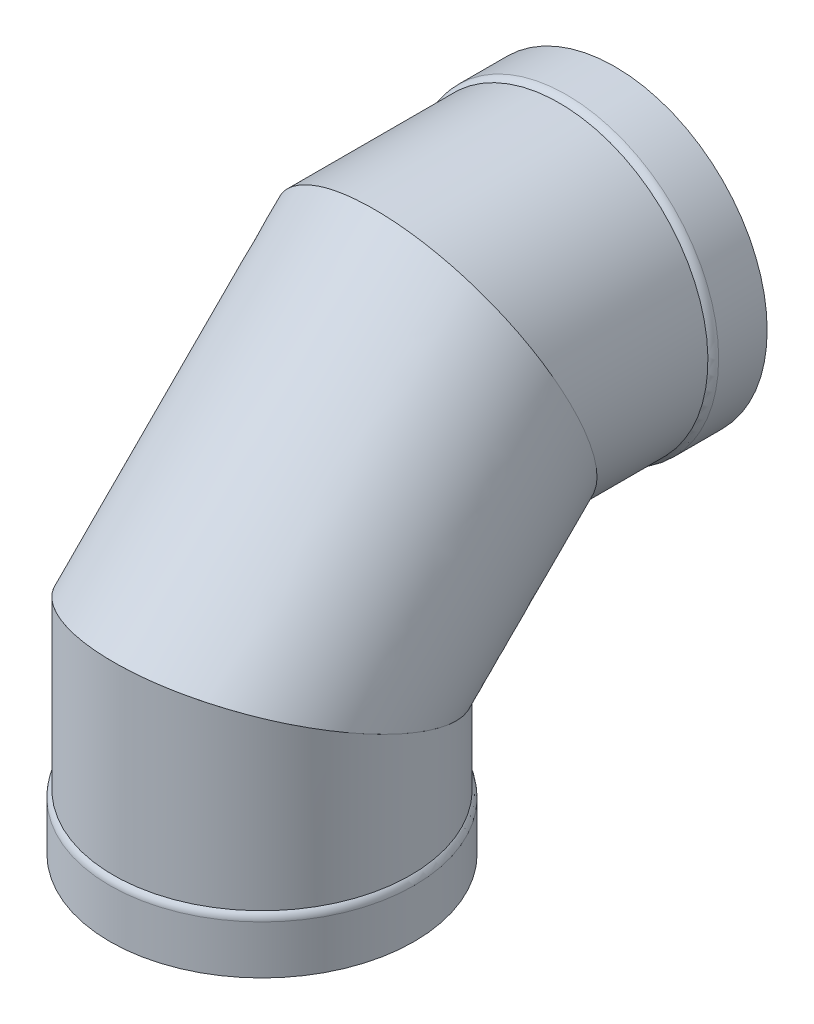
ISO-10303-21;
HEADER;
FILE_DESCRIPTION(('STEP AP214'),'2;1');
FILE_NAME('part.step','',(''),(''),'','','');
FILE_SCHEMA(('AUTOMOTIVE_DESIGN { 1 0 10303 214 1 1 1 1 }'));
ENDSEC;
DATA;
#1=APPLICATION_CONTEXT('core data for automotive mechanical design processes');
#2=APPLICATION_PROTOCOL_DEFINITION('international standard','automotive_design',2000,#1);
#3=PRODUCT_CONTEXT('',#1,'mechanical');
#4=PRODUCT('Part','Part','',(#3));
#5=PRODUCT_RELATED_PRODUCT_CATEGORY('part','',(#4));
#6=PRODUCT_DEFINITION_FORMATION('','',#4);
#7=PRODUCT_DEFINITION_CONTEXT('part definition',#1,'design');
#8=PRODUCT_DEFINITION('design','',#6,#7);
#9=PRODUCT_DEFINITION_SHAPE('','',#8);
#10=(LENGTH_UNIT() NAMED_UNIT(*) SI_UNIT(.MILLI.,.METRE.));
#11=(NAMED_UNIT(*) PLANE_ANGLE_UNIT() SI_UNIT($,.RADIAN.));
#12=(NAMED_UNIT(*) SI_UNIT($,.STERADIAN.) SOLID_ANGLE_UNIT());
#13=UNCERTAINTY_MEASURE_WITH_UNIT(LENGTH_MEASURE(1.E-05),#10,'distance_accuracy_value','');
#14=(GEOMETRIC_REPRESENTATION_CONTEXT(3) GLOBAL_UNCERTAINTY_ASSIGNED_CONTEXT((#13)) GLOBAL_UNIT_ASSIGNED_CONTEXT((#10,
#11,#12)) REPRESENTATION_CONTEXT('',''));
#15=CARTESIAN_POINT('',(0.,0.,0.));
#16=DIRECTION('',(0.,0.,1.));
#17=DIRECTION('',(1.,0.,0.));
#18=AXIS2_PLACEMENT_3D('',#15,#16,#17);
#19=CARTESIAN_POINT('',(0.,482.525889647267,-238.050889647267));
#20=DIRECTION('',(0.,-0.38256429797913,0.923928870591095));
#21=DIRECTION('',(0.,-0.923928870591095,-0.38256429797913));
#22=AXIS2_PLACEMENT_3D('',#19,#20,#21);
#23=PLANE('',#22);
#24=CARTESIAN_POINT('',(0.,482.525889647267,-238.050889647267));
#25=DIRECTION('',(0.,-0.38256429797913,0.923928870591095));
#26=DIRECTION('',(0.,-0.923928870591095,-0.38256429797913));
#27=AXIS2_PLACEMENT_3D('',#24,#25,#26);
#28=ELLIPSE('',#27,214.775732544267,198.4375);
#29=CARTESIAN_POINT('',(0.,284.088389647268,-320.216416991017));
#30=VERTEX_POINT('',#29);
#31=EDGE_CURVE('E91',#30,#30,#28,.T.);
#32=ORIENTED_EDGE('',*,*,#31,.T.);
#33=EDGE_LOOP('',(#32));
#34=FACE_BOUND('',#33,.T.);
#35=CARTESIAN_POINT('',(0.,482.525889647267,-238.050889647267));
#36=DIRECTION('',(0.,-0.38256429797913,0.923928870591095));
#37=DIRECTION('',(0.,-0.923928870591095,-0.38256429797913));
#38=AXIS2_PLACEMENT_3D('',#35,#36,#37);
#39=ELLIPSE('',#38,219.93035012533,203.2);
#40=CARTESIAN_POINT('',(0.,279.325889647268,-322.188389647267));
#41=VERTEX_POINT('',#40);
#42=EDGE_CURVE('E12',#41,#41,#39,.T.);
#43=ORIENTED_EDGE('',*,*,#42,.F.);
#44=EDGE_LOOP('',(#43));
#45=FACE_BOUND('',#44,.T.);
#46=ADVANCED_FACE('F74',(#34,#45),#23,.F.);
#47=CARTESIAN_POINT('',(0.,244.475,0.));
#48=DIRECTION('',(0.,0.923928870591096,-0.382564297979126));
#49=DIRECTION('',(0.,0.382564297979126,0.923928870591096));
#50=AXIS2_PLACEMENT_3D('',#47,#48,#49);
#51=PLANE('',#50);
#52=CARTESIAN_POINT('',(0.,244.475,0.));
#53=DIRECTION('',(0.,0.923928870591096,-0.382564297979126));
#54=DIRECTION('',(0.,-0.382564297979126,-0.923928870591096));
#55=AXIS2_PLACEMENT_3D('',#52,#53,#54);
#56=ELLIPSE('',#55,214.775732544267,198.4375);
#57=CARTESIAN_POINT('',(0.,162.30947265625,-198.4375));
#58=VERTEX_POINT('',#57);
#59=EDGE_CURVE('E105',#58,#58,#56,.T.);
#60=ORIENTED_EDGE('',*,*,#59,.T.);
#61=EDGE_LOOP('',(#60));
#62=FACE_BOUND('',#61,.T.);
#63=CARTESIAN_POINT('',(0.,244.475,0.));
#64=DIRECTION('',(0.,0.923928870591096,-0.382564297979126));
#65=DIRECTION('',(0.,-0.382564297979126,-0.923928870591096));
#66=AXIS2_PLACEMENT_3D('',#63,#64,#65);
#67=ELLIPSE('',#66,219.930350125329,203.2);
#68=CARTESIAN_POINT('',(0.,160.3375,-203.2));
#69=VERTEX_POINT('',#68);
#70=EDGE_CURVE('E83',#69,#69,#67,.T.);
#71=ORIENTED_EDGE('',*,*,#70,.F.);
#72=EDGE_LOOP('',(#71));
#73=FACE_BOUND('',#72,.T.);
#74=ADVANCED_FACE('F113',(#62,#73),#51,.F.);
#75=CARTESIAN_POINT('',(0.0254635976283914,328.61249933938,203.19999840454));
#76=CARTESIAN_POINT('',(0.081836873117919,685.725873167754,-153.913396470814));
#77=CARTESIAN_POINT('',(406.425460406709,328.591412297594,203.149071209284));
#78=CARTESIAN_POINT('',(406.481803914092,685.562199421518,-153.981167631365));
#79=CARTESIAN_POINT('',(406.374533211452,160.316413618834,-203.250925599797));
#80=CARTESIAN_POINT('',(406.318130167856,279.162232380545,-322.25615398427));
#81=CARTESIAN_POINT('',(-0.0254635976285066,160.33750066062,-203.19999840454));
#82=CARTESIAN_POINT('',(-0.0818368731179439,279.325906126781,-322.188382823719));
#83=CARTESIAN_POINT('',(-406.425460406709,160.358587702406,-203.149071209283));
#84=CARTESIAN_POINT('',(-406.481803914092,279.489579873017,-322.120611663168));
#85=CARTESIAN_POINT('',(-406.374533211452,328.633586381166,203.250925599797));
#86=CARTESIAN_POINT('',(-406.318130167856,685.88954691399,-153.845625310263));
#87=CARTESIAN_POINT('',(0.0254635976283914,328.61249933938,203.19999840454));
#88=CARTESIAN_POINT('',(0.081836873117919,685.725873167754,-153.913396470814));
#89=(BOUNDED_SURFACE() B_SPLINE_SURFACE(3,1,((#75,#76),(#77,#78),(#79,#80),(#81,#82),(#83,#84),
(#85,#86),(#87,#88)),.UNSPECIFIED.,.T.,.F.,.F.) B_SPLINE_SURFACE_WITH_KNOTS((4,3,4),(2,2),(0.,
0.5,1.),(0.,1.),.UNSPECIFIED.) GEOMETRIC_REPRESENTATION_ITEM() RATIONAL_B_SPLINE_SURFACE(((1.,
1.),(0.333333333333333,0.333333333333333),(0.333333333333333,0.333333333333333),(1.,1.),
(0.333333333333333,0.333333333333333),(0.333333333333333,0.333333333333333),(1.,1.))) REPRESENTATION_ITEM('') SURFACE());
#90=ORIENTED_EDGE('',*,*,#70,.T.);
#91=EDGE_LOOP('',(#90));
#92=FACE_BOUND('',#91,.T.);
#93=ORIENTED_EDGE('',*,*,#42,.T.);
#94=EDGE_LOOP('',(#93));
#95=FACE_BOUND('',#94,.T.);
#96=ADVANCED_FACE('F133',(#92,#95),#89,.T.);
#97=CARTESIAN_POINT('',(0.,162.30947265625,-198.4375));
#98=CARTESIAN_POINT('',(0.,284.088389647268,-320.216416991017));
#99=CARTESIAN_POINT('',(-396.875,162.30947265625,-198.4375));
#100=CARTESIAN_POINT('',(-396.875,284.088389647268,-320.216416991017));
#101=CARTESIAN_POINT('',(-396.875,326.64052734375,198.4375));
#102=CARTESIAN_POINT('',(-396.875,680.963389647267,-155.885362303516));
#103=CARTESIAN_POINT('',(0.,326.64052734375,198.4375));
#104=CARTESIAN_POINT('',(0.,680.963389647267,-155.885362303516));
#105=CARTESIAN_POINT('',(396.875,326.64052734375,198.4375));
#106=CARTESIAN_POINT('',(396.875,680.963389647267,-155.885362303516));
#107=CARTESIAN_POINT('',(396.875,162.30947265625,-198.4375));
#108=CARTESIAN_POINT('',(396.875,284.088389647268,-320.216416991017));
#109=CARTESIAN_POINT('',(0.,162.30947265625,-198.4375));
#110=CARTESIAN_POINT('',(0.,284.088389647268,-320.216416991017));
#111=(BOUNDED_SURFACE() B_SPLINE_SURFACE(3,1,((#97,#98),(#99,#100),(#101,#102),(#103,#104),
(#105,#106),(#107,#108),(#109,#110)),.UNSPECIFIED.,.T.,.F.,.F.) B_SPLINE_SURFACE_WITH_KNOTS((4,
3,4),(2,2),(0.,0.5,1.),(0.,1.),
.UNSPECIFIED.) GEOMETRIC_REPRESENTATION_ITEM() RATIONAL_B_SPLINE_SURFACE(((1.,1.),
(0.333333333333333,0.333333333333333),(0.333333333333333,0.333333333333333),(1.,1.),
(0.333333333333333,0.333333333333333),(0.333333333333333,0.333333333333333),(1.,1.))) REPRESENTATION_ITEM('') SURFACE());
#112=ORIENTED_EDGE('',*,*,#59,.F.);
#113=EDGE_LOOP('',(#112));
#114=FACE_BOUND('',#113,.T.);
#115=ORIENTED_EDGE('',*,*,#31,.F.);
#116=EDGE_LOOP('',(#115));
#117=FACE_BOUND('',#116,.T.);
#118=ADVANCED_FACE('F134',(#114,#117),#111,.F.);
#119=CLOSED_SHELL('',(#46,#74,#96,#118));
#120=MANIFOLD_SOLID_BREP('B2',#119);
#121=CARTESIAN_POINT('',(0.,482.525889647269,-534.639682750715));
#122=DIRECTION('',(0.,0.,-1.));
#123=DIRECTION('',(0.,-1.,0.));
#124=AXIS2_PLACEMENT_3D('',#121,#122,#123);
#125=CYLINDRICAL_SURFACE('',#124,203.2);
#126=CARTESIAN_POINT('',(0.,482.525889647268,-406.325889647266));
#127=DIRECTION('',(0.,0.,1.));
#128=DIRECTION('',(0.,-1.,0.));
#129=AXIS2_PLACEMENT_3D('',#126,#127,#128);
#130=CIRCLE('',#129,203.2);
#131=CARTESIAN_POINT('',(0.,279.325889647268,-406.325889647267));
#132=VERTEX_POINT('',#131);
#133=EDGE_CURVE('E275',#132,#132,#130,.T.);
#134=ORIENTED_EDGE('',*,*,#133,.T.);
#135=EDGE_LOOP('',(#134));
#136=FACE_BOUND('',#135,.T.);
#137=CARTESIAN_POINT('',(0.,482.525889647267,-238.050889647266));
#138=DIRECTION('',(0.,-0.38256429797913,0.923928870591095));
#139=DIRECTION('',(0.,-0.923928870591095,-0.38256429797913));
#140=AXIS2_PLACEMENT_3D('',#137,#138,#139);
#141=ELLIPSE('',#140,219.930350125329,203.2);
#142=CARTESIAN_POINT('',(0.,279.325889647268,-322.188389647267));
#143=VERTEX_POINT('',#142);
#144=EDGE_CURVE('E287',#143,#143,#141,.T.);
#145=ORIENTED_EDGE('',*,*,#144,.F.);
#146=EDGE_LOOP('',(#145));
#147=FACE_BOUND('',#146,.T.);
#148=ADVANCED_FACE('F261',(#136,#147),#125,.T.);
#149=CARTESIAN_POINT('',(0.,482.525889647269,-534.639682750715));
#150=DIRECTION('',(0.,0.,-1.));
#151=DIRECTION('',(0.,-1.,0.));
#152=AXIS2_PLACEMENT_3D('',#149,#150,#151);
#153=CYLINDRICAL_SURFACE('',#152,207.9625);
#154=CARTESIAN_POINT('',(0.,482.525889647268,-416.239823969724));
#155=DIRECTION('',(0.,0.,1.));
#156=DIRECTION('',(0.,-1.,0.));
#157=AXIS2_PLACEMENT_3D('',#154,#155,#156);
#158=CIRCLE('',#157,207.9625);
#159=CARTESIAN_POINT('',(0.,274.563389647268,-416.239823969725));
#160=VERTEX_POINT('',#159);
#161=EDGE_CURVE('E269',#160,#160,#158,.F.);
#162=ORIENTED_EDGE('',*,*,#161,.T.);
#163=EDGE_LOOP('',(#162));
#164=FACE_BOUND('',#163,.T.);
#165=CARTESIAN_POINT('',(0.,482.525889647268,-482.525889647266));
#166=DIRECTION('',(0.,0.,1.));
#167=DIRECTION('',(0.,-1.,0.));
#168=AXIS2_PLACEMENT_3D('',#165,#166,#167);
#169=CIRCLE('',#168,207.9625);
#170=CARTESIAN_POINT('',(0.,274.563389647268,-482.525889647267));
#171=VERTEX_POINT('',#170);
#172=EDGE_CURVE('E281',#171,#171,#169,.T.);
#173=ORIENTED_EDGE('',*,*,#172,.T.);
#174=EDGE_LOOP('',(#173));
#175=FACE_BOUND('',#174,.T.);
#176=ADVANCED_FACE('F308',(#164,#175),#153,.T.);
#177=CARTESIAN_POINT('',(0.,690.488389647268,-482.525889647265));
#178=DIRECTION('',(0.,0.,1.));
#179=DIRECTION('',(0.,1.,0.));
#180=AXIS2_PLACEMENT_3D('',#177,#178,#179);
#181=PLANE('',#180);
#182=CARTESIAN_POINT('',(0.,482.525889647268,-482.525889647266));
#183=DIRECTION('',(0.,0.,1.));
#184=DIRECTION('',(0.,-1.,0.));
#185=AXIS2_PLACEMENT_3D('',#182,#183,#184);
#186=CIRCLE('',#185,203.2);
#187=CARTESIAN_POINT('',(0.,279.325889647268,-482.525889647267));
#188=VERTEX_POINT('',#187);
#189=EDGE_CURVE('E292',#188,#188,#186,.T.);
#190=ORIENTED_EDGE('',*,*,#189,.T.);
#191=EDGE_LOOP('',(#190));
#192=FACE_BOUND('',#191,.T.);
#193=ORIENTED_EDGE('',*,*,#172,.F.);
#194=EDGE_LOOP('',(#193));
#195=FACE_BOUND('',#194,.T.);
#196=ADVANCED_FACE('F314',(#192,#195),#181,.F.);
#197=CARTESIAN_POINT('',(0.,482.525889647269,-534.639682750715));
#198=DIRECTION('',(0.,0.,-1.));
#199=DIRECTION('',(0.,-1.,0.));
#200=AXIS2_PLACEMENT_3D('',#197,#198,#199);
#201=CYLINDRICAL_SURFACE('',#200,203.2);
#202=CARTESIAN_POINT('',(0.,482.525889647268,-421.002323969724));
#203=DIRECTION('',(0.,0.,1.));
#204=DIRECTION('',(0.,-1.,0.));
#205=AXIS2_PLACEMENT_3D('',#202,#203,#204);
#206=CIRCLE('',#205,203.2);
#207=CARTESIAN_POINT('',(0.,279.325889647268,-421.002323969725));
#208=VERTEX_POINT('',#207);
#209=EDGE_CURVE('E73',#208,#208,#206,.T.);
#210=ORIENTED_EDGE('',*,*,#209,.T.);
#211=EDGE_LOOP('',(#210));
#212=FACE_BOUND('',#211,.T.);
#213=ORIENTED_EDGE('',*,*,#189,.F.);
#214=EDGE_LOOP('',(#213));
#215=FACE_BOUND('',#214,.T.);
#216=ADVANCED_FACE('F333',(#212,#215),#201,.F.);
#217=CARTESIAN_POINT('',(0.,482.525889647269,-534.639682750715));
#218=DIRECTION('',(0.,0.,-1.));
#219=DIRECTION('',(0.,-1.,0.));
#220=AXIS2_PLACEMENT_3D('',#217,#218,#219);
#221=CYLINDRICAL_SURFACE('',#220,198.4375);
#222=CARTESIAN_POINT('',(0.,482.525889647267,-238.050889647266));
#223=DIRECTION('',(0.,-0.38256429797913,0.923928870591095));
#224=DIRECTION('',(0.,-0.923928870591095,-0.38256429797913));
#225=AXIS2_PLACEMENT_3D('',#222,#223,#224);
#226=ELLIPSE('',#225,214.775732544267,198.4375);
#227=CARTESIAN_POINT('',(0.,284.088389647268,-320.216416991017));
#228=VERTEX_POINT('',#227);
#229=EDGE_CURVE('E284',#228,#228,#226,.F.);
#230=ORIENTED_EDGE('',*,*,#229,.F.);
#231=EDGE_LOOP('',(#230));
#232=FACE_BOUND('',#231,.T.);
#233=CARTESIAN_POINT('',(0.,482.525889647268,-411.088389647266));
#234=DIRECTION('',(0.,0.,1.));
#235=DIRECTION('',(0.,-1.,0.));
#236=AXIS2_PLACEMENT_3D('',#233,#234,#235);
#237=CIRCLE('',#236,198.4375);
#238=CARTESIAN_POINT('',(0.,284.088389647268,-411.088389647267));
#239=VERTEX_POINT('',#238);
#240=EDGE_CURVE('E296',#239,#239,#237,.T.);
#241=ORIENTED_EDGE('',*,*,#240,.F.);
#242=EDGE_LOOP('',(#241));
#243=FACE_BOUND('',#242,.T.);
#244=ADVANCED_FACE('F325',(#232,#243),#221,.F.);
#245=CARTESIAN_POINT('',(-207.9625,685.725889647267,-153.913389647265));
#246=DIRECTION('',(0.,0.38256429797913,-0.923928870591095));
#247=DIRECTION('',(0.,-0.923928870591095,-0.38256429797913));
#248=AXIS2_PLACEMENT_3D('',#245,#246,#247);
#249=PLANE('',#248);
#250=ORIENTED_EDGE('',*,*,#229,.T.);
#251=EDGE_LOOP('',(#250));
#252=FACE_BOUND('',#251,.T.);
#253=ORIENTED_EDGE('',*,*,#144,.T.);
#254=EDGE_LOOP('',(#253));
#255=FACE_BOUND('',#254,.T.);
#256=ADVANCED_FACE('F305',(#252,#255),#249,.F.);
#257=CARTESIAN_POINT('',(0.,482.525889647268,-416.239823969724));
#258=DIRECTION('',(0.,0.,1.));
#259=DIRECTION('',(0.,-1.,0.));
#260=AXIS2_PLACEMENT_3D('',#257,#258,#259);
#261=TOROIDAL_SURFACE('',#260,195.2625,12.7);
#262=ORIENTED_EDGE('',*,*,#161,.F.);
#263=EDGE_LOOP('',(#262));
#264=FACE_BOUND('',#263,.T.);
#265=ORIENTED_EDGE('',*,*,#133,.F.);
#266=EDGE_LOOP('',(#265));
#267=FACE_BOUND('',#266,.T.);
#268=ADVANCED_FACE('F317',(#264,#267),#261,.T.);
#269=CARTESIAN_POINT('',(0.,482.525889647268,-421.002323969724));
#270=DIRECTION('',(0.,0.,1.));
#271=DIRECTION('',(0.,-1.,0.));
#272=AXIS2_PLACEMENT_3D('',#269,#270,#271);
#273=TOROIDAL_SURFACE('',#272,190.5,12.7);
#274=ORIENTED_EDGE('',*,*,#240,.T.);
#275=EDGE_LOOP('',(#274));
#276=FACE_BOUND('',#275,.T.);
#277=ORIENTED_EDGE('',*,*,#209,.F.);
#278=EDGE_LOOP('',(#277));
#279=FACE_BOUND('',#278,.T.);
#280=ADVANCED_FACE('F263',(#276,#279),#273,.F.);
#281=CLOSED_SHELL('',(#148,#176,#196,#216,#244,#256,#268,#280));
#282=MANIFOLD_SOLID_BREP('B7',#281);
#283=CARTESIAN_POINT('',(0.,-52.1137931034483,0.));
#284=DIRECTION('',(0.,-1.,0.));
#285=DIRECTION('',(0.,0.,-1.));
#286=AXIS2_PLACEMENT_3D('',#283,#284,#285);
#287=CYLINDRICAL_SURFACE('',#286,203.2);
#288=CARTESIAN_POINT('',(0.,76.2,0.));
#289=DIRECTION('',(0.,-1.,0.));
#290=DIRECTION('',(0.,0.,-1.));
#291=AXIS2_PLACEMENT_3D('',#288,#289,#290);
#292=CIRCLE('',#291,203.2);
#293=CARTESIAN_POINT('',(0.,76.2,-203.2));
#294=VERTEX_POINT('',#293);
#295=EDGE_CURVE('E429',#294,#294,#292,.T.);
#296=ORIENTED_EDGE('',*,*,#295,.F.);
#297=EDGE_LOOP('',(#296));
#298=FACE_BOUND('',#297,.T.);
#299=CARTESIAN_POINT('',(0.,244.475,0.));
#300=DIRECTION('',(0.,-0.923928870591096,0.382564297979126));
#301=DIRECTION('',(0.,-0.382564297979126,-0.923928870591096));
#302=AXIS2_PLACEMENT_3D('',#299,#300,#301);
#303=ELLIPSE('',#302,219.930350125329,203.2);
#304=CARTESIAN_POINT('',(0.,160.3375,-203.2));
#305=VERTEX_POINT('',#304);
#306=EDGE_CURVE('E441',#305,#305,#303,.T.);
#307=ORIENTED_EDGE('',*,*,#306,.T.);
#308=EDGE_LOOP('',(#307));
#309=FACE_BOUND('',#308,.T.);
#310=ADVANCED_FACE('F415',(#298,#309),#287,.T.);
#311=CARTESIAN_POINT('',(0.,-52.1137931034483,0.));
#312=DIRECTION('',(0.,-1.,0.));
#313=DIRECTION('',(0.,0.,-1.));
#314=AXIS2_PLACEMENT_3D('',#311,#312,#313);
#315=CYLINDRICAL_SURFACE('',#314,207.9625);
#316=CARTESIAN_POINT('',(0.,66.2860656775425,0.));
#317=DIRECTION('',(0.,1.,0.));
#318=DIRECTION('',(0.,0.,1.));
#319=AXIS2_PLACEMENT_3D('',#316,#317,#318);
#320=CIRCLE('',#319,207.9625);
#321=CARTESIAN_POINT('',(0.,66.2860656775425,207.9625));
#322=VERTEX_POINT('',#321);
#323=EDGE_CURVE('E260',#322,#322,#320,.F.);
#324=ORIENTED_EDGE('',*,*,#323,.T.);
#325=EDGE_LOOP('',(#324));
#326=FACE_BOUND('',#325,.T.);
#327=CARTESIAN_POINT('',(0.,0.,0.));
#328=DIRECTION('',(0.,-1.,0.));
#329=DIRECTION('',(0.,0.,-1.));
#330=AXIS2_PLACEMENT_3D('',#327,#328,#329);
#331=CIRCLE('',#330,207.9625);
#332=CARTESIAN_POINT('',(0.,0.,-207.9625));
#333=VERTEX_POINT('',#332);
#334=EDGE_CURVE('E435',#333,#333,#331,.T.);
#335=ORIENTED_EDGE('',*,*,#334,.F.);
#336=EDGE_LOOP('',(#335));
#337=FACE_BOUND('',#336,.T.);
#338=ADVANCED_FACE('F476',(#326,#337),#315,.T.);
#339=CARTESIAN_POINT('',(0.,0.,207.9625));
#340=DIRECTION('',(0.,1.,0.));
#341=DIRECTION('',(0.,0.,1.));
#342=AXIS2_PLACEMENT_3D('',#339,#340,#341);
#343=PLANE('',#342);
#344=CARTESIAN_POINT('',(0.,0.,0.));
#345=DIRECTION('',(0.,-1.,0.));
#346=DIRECTION('',(0.,0.,-1.));
#347=AXIS2_PLACEMENT_3D('',#344,#345,#346);
#348=CIRCLE('',#347,203.2);
#349=CARTESIAN_POINT('',(0.,0.,-203.2));
#350=VERTEX_POINT('',#349);
#351=EDGE_CURVE('E446',#350,#350,#348,.T.);
#352=ORIENTED_EDGE('',*,*,#351,.F.);
#353=EDGE_LOOP('',(#352));
#354=FACE_BOUND('',#353,.T.);
#355=ORIENTED_EDGE('',*,*,#334,.T.);
#356=EDGE_LOOP('',(#355));
#357=FACE_BOUND('',#356,.T.);
#358=ADVANCED_FACE('F482',(#354,#357),#343,.F.);
#359=CARTESIAN_POINT('',(0.,-52.1137931034483,0.));
#360=DIRECTION('',(0.,-1.,0.));
#361=DIRECTION('',(0.,0.,-1.));
#362=AXIS2_PLACEMENT_3D('',#359,#360,#361);
#363=CYLINDRICAL_SURFACE('',#362,203.2);
#364=CARTESIAN_POINT('',(0.,61.5235656775425,0.));
#365=DIRECTION('',(0.,1.,0.));
#366=DIRECTION('',(0.,0.,1.));
#367=AXIS2_PLACEMENT_3D('',#364,#365,#366);
#368=CIRCLE('',#367,203.2);
#369=CARTESIAN_POINT('',(0.,61.5235656775425,203.2));
#370=VERTEX_POINT('',#369);
#371=EDGE_CURVE('E423',#370,#370,#368,.T.);
#372=ORIENTED_EDGE('',*,*,#371,.T.);
#373=EDGE_LOOP('',(#372));
#374=FACE_BOUND('',#373,.T.);
#375=ORIENTED_EDGE('',*,*,#351,.T.);
#376=EDGE_LOOP('',(#375));
#377=FACE_BOUND('',#376,.T.);
#378=ADVANCED_FACE('F471',(#374,#377),#363,.F.);
#379=CARTESIAN_POINT('',(0.,-52.1137931034483,0.));
#380=DIRECTION('',(0.,-1.,0.));
#381=DIRECTION('',(0.,0.,-1.));
#382=AXIS2_PLACEMENT_3D('',#379,#380,#381);
#383=CYLINDRICAL_SURFACE('',#382,198.4375);
#384=CARTESIAN_POINT('',(0.,244.475,0.));
#385=DIRECTION('',(0.,-0.923928870591096,0.382564297979126));
#386=DIRECTION('',(0.,-0.382564297979126,-0.923928870591096));
#387=AXIS2_PLACEMENT_3D('',#384,#385,#386);
#388=ELLIPSE('',#387,214.775732544267,198.4375);
#389=CARTESIAN_POINT('',(0.,162.30947265625,-198.4375));
#390=VERTEX_POINT('',#389);
#391=EDGE_CURVE('E438',#390,#390,#388,.F.);
#392=ORIENTED_EDGE('',*,*,#391,.T.);
#393=EDGE_LOOP('',(#392));
#394=FACE_BOUND('',#393,.T.);
#395=CARTESIAN_POINT('',(0.,71.4375,0.));
#396=DIRECTION('',(0.,-1.,0.));
#397=DIRECTION('',(0.,0.,-1.));
#398=AXIS2_PLACEMENT_3D('',#395,#396,#397);
#399=CIRCLE('',#398,198.4375);
#400=CARTESIAN_POINT('',(0.,71.4375,-198.4375));
#401=VERTEX_POINT('',#400);
#402=EDGE_CURVE('E450',#401,#401,#399,.T.);
#403=ORIENTED_EDGE('',*,*,#402,.T.);
#404=EDGE_LOOP('',(#403));
#405=FACE_BOUND('',#404,.T.);
#406=ADVANCED_FACE('F463',(#394,#405),#383,.F.);
#407=CARTESIAN_POINT('',(-207.9625,328.6125,203.2));
#408=DIRECTION('',(0.,-0.923928870591096,0.382564297979126));
#409=DIRECTION('',(0.,-0.382564297979126,-0.923928870591096));
#410=AXIS2_PLACEMENT_3D('',#407,#408,#409);
#411=PLANE('',#410);
#412=ORIENTED_EDGE('',*,*,#391,.F.);
#413=EDGE_LOOP('',(#412));
#414=FACE_BOUND('',#413,.T.);
#415=ORIENTED_EDGE('',*,*,#306,.F.);
#416=EDGE_LOOP('',(#415));
#417=FACE_BOUND('',#416,.T.);
#418=ADVANCED_FACE('F460',(#414,#417),#411,.F.);
#419=CARTESIAN_POINT('',(0.,61.5235656775425,0.));
#420=DIRECTION('',(0.,1.,0.));
#421=DIRECTION('',(0.,0.,1.));
#422=AXIS2_PLACEMENT_3D('',#419,#420,#421);
#423=TOROIDAL_SURFACE('',#422,190.5,12.7);
#424=ORIENTED_EDGE('',*,*,#371,.F.);
#425=EDGE_LOOP('',(#424));
#426=FACE_BOUND('',#425,.T.);
#427=ORIENTED_EDGE('',*,*,#402,.F.);
#428=EDGE_LOOP('',(#427));
#429=FACE_BOUND('',#428,.T.);
#430=ADVANCED_FACE('F462',(#426,#429),#423,.F.);
#431=CARTESIAN_POINT('',(0.,66.2860656775425,0.));
#432=DIRECTION('',(0.,1.,0.));
#433=DIRECTION('',(0.,0.,1.));
#434=AXIS2_PLACEMENT_3D('',#431,#432,#433);
#435=TOROIDAL_SURFACE('',#434,195.2625,12.7);
#436=ORIENTED_EDGE('',*,*,#295,.T.);
#437=EDGE_LOOP('',(#436));
#438=FACE_BOUND('',#437,.T.);
#439=ORIENTED_EDGE('',*,*,#323,.F.);
#440=EDGE_LOOP('',(#439));
#441=FACE_BOUND('',#440,.T.);
#442=ADVANCED_FACE('F417',(#438,#441),#435,.T.);
#443=CLOSED_SHELL('',(#310,#338,#358,#378,#406,#418,#430,#442));
#444=MANIFOLD_SOLID_BREP('B68',#443);
#445=ADVANCED_BREP_SHAPE_REPRESENTATION('',(#18,#120,#282,#444),#14);
#446=SHAPE_DEFINITION_REPRESENTATION(#9,#445);
ENDSEC;
END-ISO-10303-21;
